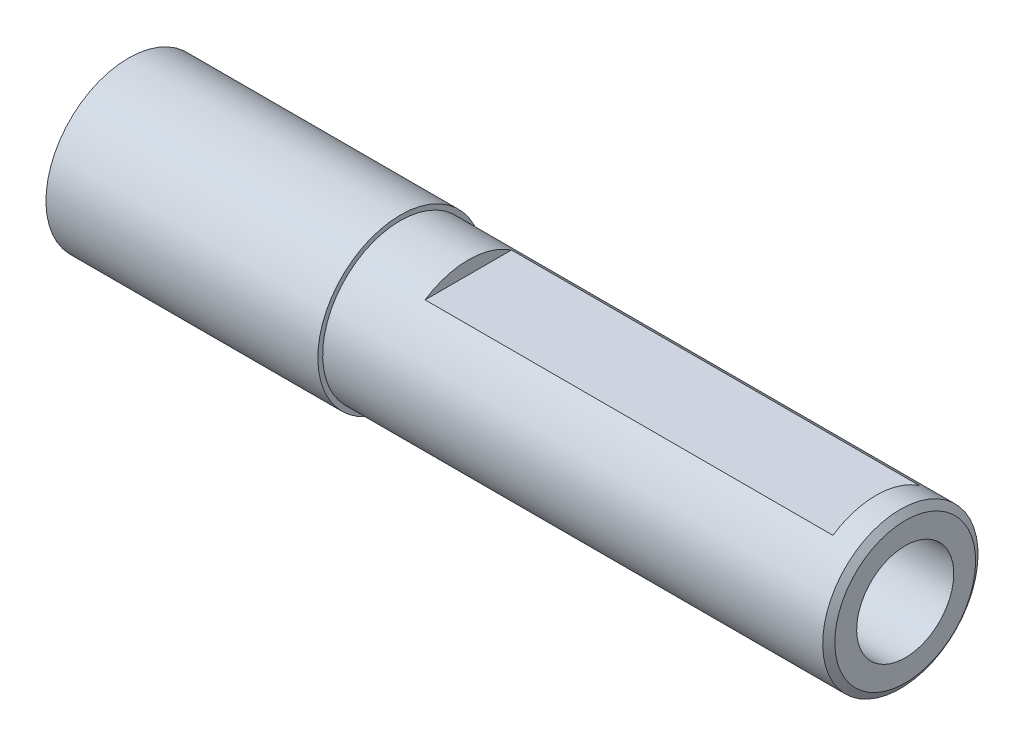
ISO-10303-21;
HEADER;
FILE_DESCRIPTION(('STEP AP214'),'2;1');
FILE_NAME('part.step','',(''),(''),'','','');
FILE_SCHEMA(('AUTOMOTIVE_DESIGN { 1 0 10303 214 1 1 1 1 }'));
ENDSEC;
DATA;
#1=APPLICATION_CONTEXT('core data for automotive mechanical design processes');
#2=APPLICATION_PROTOCOL_DEFINITION('international standard','automotive_design',2000,#1);
#3=PRODUCT_CONTEXT('',#1,'mechanical');
#4=PRODUCT('Part','Part','',(#3));
#5=PRODUCT_RELATED_PRODUCT_CATEGORY('part','',(#4));
#6=PRODUCT_DEFINITION_FORMATION('','',#4);
#7=PRODUCT_DEFINITION_CONTEXT('part definition',#1,'design');
#8=PRODUCT_DEFINITION('design','',#6,#7);
#9=PRODUCT_DEFINITION_SHAPE('','',#8);
#10=(LENGTH_UNIT() NAMED_UNIT(*) SI_UNIT(.MILLI.,.METRE.));
#11=(NAMED_UNIT(*) PLANE_ANGLE_UNIT() SI_UNIT($,.RADIAN.));
#12=(NAMED_UNIT(*) SI_UNIT($,.STERADIAN.) SOLID_ANGLE_UNIT());
#13=UNCERTAINTY_MEASURE_WITH_UNIT(LENGTH_MEASURE(1.E-05),#10,'distance_accuracy_value','');
#14=(GEOMETRIC_REPRESENTATION_CONTEXT(3) GLOBAL_UNCERTAINTY_ASSIGNED_CONTEXT((#13)) GLOBAL_UNIT_ASSIGNED_CONTEXT((#10,
#11,#12)) REPRESENTATION_CONTEXT('',''));
#15=CARTESIAN_POINT('',(0.,0.,0.));
#16=DIRECTION('',(0.,0.,1.));
#17=DIRECTION('',(1.,0.,0.));
#18=AXIS2_PLACEMENT_3D('',#15,#16,#17);
#19=CARTESIAN_POINT('',(52.,0.,0.));
#20=DIRECTION('',(1.,0.,0.));
#21=DIRECTION('',(0.,1.,0.));
#22=AXIS2_PLACEMENT_3D('',#19,#20,#21);
#23=CYLINDRICAL_SURFACE('',#22,8.);
#24=CARTESIAN_POINT('',(0.,0.,0.));
#25=DIRECTION('',(1.,0.,0.));
#26=DIRECTION('',(0.,1.,0.));
#27=AXIS2_PLACEMENT_3D('',#24,#25,#26);
#28=CIRCLE('',#27,8.);
#29=CARTESIAN_POINT('',(0.,7.99999999999999,0.));
#30=VERTEX_POINT('',#29);
#31=EDGE_CURVE('E62',#30,#30,#28,.T.);
#32=ORIENTED_EDGE('',*,*,#31,.T.);
#33=EDGE_LOOP('',(#32));
#34=FACE_BOUND('',#33,.T.);
#35=CARTESIAN_POINT('',(51.5,0.,0.));
#36=DIRECTION('',(1.,0.,0.));
#37=DIRECTION('',(0.,1.,0.));
#38=AXIS2_PLACEMENT_3D('',#35,#36,#37);
#39=CIRCLE('',#38,8.);
#40=CARTESIAN_POINT('',(51.5,8.,0.));
#41=VERTEX_POINT('',#40);
#42=EDGE_CURVE('E70',#41,#41,#39,.T.);
#43=ORIENTED_EDGE('',*,*,#42,.F.);
#44=EDGE_LOOP('',(#43));
#45=FACE_BOUND('',#44,.T.);
#46=DIRECTION('',(1.,0.,0.));
#47=VECTOR('',#46,1.);
#48=CARTESIAN_POINT('',(52.,6.65,4.44719012411207));
#49=LINE('',#48,#47);
#50=CARTESIAN_POINT('',(7.,6.64999999999999,4.44719012411207));
#51=VERTEX_POINT('',#50);
#52=CARTESIAN_POINT('',(49.,6.65,4.44719012411207));
#53=VERTEX_POINT('',#52);
#54=EDGE_CURVE('E39',#51,#53,#49,.T.);
#55=ORIENTED_EDGE('',*,*,#54,.F.);
#56=CARTESIAN_POINT('',(7.00000000000001,0.,0.));
#57=DIRECTION('',(1.,0.,0.));
#58=DIRECTION('',(0.,1.,0.));
#59=AXIS2_PLACEMENT_3D('',#56,#57,#58);
#60=CIRCLE('',#59,8.);
#61=CARTESIAN_POINT('',(7.,6.64999999999999,-4.44719012411207));
#62=VERTEX_POINT('',#61);
#63=EDGE_CURVE('E11',#62,#51,#60,.T.);
#64=ORIENTED_EDGE('',*,*,#63,.F.);
#65=DIRECTION('',(1.,0.,0.));
#66=VECTOR('',#65,1.);
#67=CARTESIAN_POINT('',(52.,6.65,-4.44719012411207));
#68=LINE('',#67,#66);
#69=CARTESIAN_POINT('',(49.,6.65,-4.44719012411207));
#70=VERTEX_POINT('',#69);
#71=EDGE_CURVE('E46',#70,#62,#68,.F.);
#72=ORIENTED_EDGE('',*,*,#71,.F.);
#73=CARTESIAN_POINT('',(49.,0.,0.));
#74=DIRECTION('',(-1.,0.,0.));
#75=DIRECTION('',(0.,0.,1.));
#76=AXIS2_PLACEMENT_3D('',#73,#74,#75);
#77=CIRCLE('',#76,8.);
#78=EDGE_CURVE('E58',#53,#70,#77,.T.);
#79=ORIENTED_EDGE('',*,*,#78,.F.);
#80=EDGE_LOOP('',(#55,#64,#72,#79));
#81=FACE_BOUND('',#80,.T.);
#82=ADVANCED_FACE('F32',(#34,#45,#81),#23,.T.);
#83=CARTESIAN_POINT('',(0.,0.,0.));
#84=DIRECTION('',(-1.,0.,0.));
#85=DIRECTION('',(0.,-1.,0.));
#86=AXIS2_PLACEMENT_3D('',#83,#84,#85);
#87=PLANE('',#86);
#88=ORIENTED_EDGE('',*,*,#31,.F.);
#89=EDGE_LOOP('',(#88));
#90=FACE_BOUND('',#89,.T.);
#91=CARTESIAN_POINT('',(0.,0.,0.));
#92=DIRECTION('',(1.,0.,0.));
#93=DIRECTION('',(0.,1.,0.));
#94=AXIS2_PLACEMENT_3D('',#91,#92,#93);
#95=CIRCLE('',#94,8.5);
#96=CARTESIAN_POINT('',(0.,8.49999999999999,0.));
#97=VERTEX_POINT('',#96);
#98=EDGE_CURVE('E85',#97,#97,#95,.T.);
#99=ORIENTED_EDGE('',*,*,#98,.T.);
#100=EDGE_LOOP('',(#99));
#101=FACE_BOUND('',#100,.T.);
#102=ADVANCED_FACE('F94',(#90,#101),#87,.F.);
#103=CARTESIAN_POINT('',(52.,0.,0.));
#104=DIRECTION('',(1.,0.,0.));
#105=DIRECTION('',(0.,1.,0.));
#106=AXIS2_PLACEMENT_3D('',#103,#104,#105);
#107=CYLINDRICAL_SURFACE('',#106,8.5);
#108=ORIENTED_EDGE('',*,*,#98,.F.);
#109=EDGE_LOOP('',(#108));
#110=FACE_BOUND('',#109,.T.);
#111=CARTESIAN_POINT('',(-28.,0.,0.));
#112=DIRECTION('',(1.,0.,0.));
#113=DIRECTION('',(0.,1.,0.));
#114=AXIS2_PLACEMENT_3D('',#111,#112,#113);
#115=CIRCLE('',#114,8.5);
#116=CARTESIAN_POINT('',(-28.,8.49999999999999,0.));
#117=VERTEX_POINT('',#116);
#118=EDGE_CURVE('E82',#117,#117,#115,.T.);
#119=ORIENTED_EDGE('',*,*,#118,.T.);
#120=EDGE_LOOP('',(#119));
#121=FACE_BOUND('',#120,.T.);
#122=ADVANCED_FACE('F97',(#110,#121),#107,.T.);
#123=CARTESIAN_POINT('',(-28.,0.,0.));
#124=DIRECTION('',(1.,0.,0.));
#125=DIRECTION('',(0.,1.,0.));
#126=AXIS2_PLACEMENT_3D('',#123,#124,#125);
#127=PLANE('',#126);
#128=ORIENTED_EDGE('',*,*,#118,.F.);
#129=EDGE_LOOP('',(#128));
#130=FACE_BOUND('',#129,.T.);
#131=ADVANCED_FACE('F102',(#130),#127,.F.);
#132=CARTESIAN_POINT('',(52.,0.,0.));
#133=DIRECTION('',(-1.,0.,0.));
#134=DIRECTION('',(0.,-1.,0.));
#135=AXIS2_PLACEMENT_3D('',#132,#133,#134);
#136=PLANE('',#135);
#137=CARTESIAN_POINT('',(52.,0.,0.));
#138=DIRECTION('',(1.,0.,0.));
#139=DIRECTION('',(0.,1.,0.));
#140=AXIS2_PLACEMENT_3D('',#137,#138,#139);
#141=CIRCLE('',#140,5.);
#142=CARTESIAN_POINT('',(52.,5.,0.));
#143=VERTEX_POINT('',#142);
#144=EDGE_CURVE('E73',#143,#143,#141,.T.);
#145=ORIENTED_EDGE('',*,*,#144,.F.);
#146=EDGE_LOOP('',(#145));
#147=FACE_BOUND('',#146,.T.);
#148=CARTESIAN_POINT('',(52.,0.,0.));
#149=DIRECTION('',(1.,0.,0.));
#150=DIRECTION('',(0.,1.,0.));
#151=AXIS2_PLACEMENT_3D('',#148,#149,#150);
#152=CIRCLE('',#151,7.25069297019762);
#153=CARTESIAN_POINT('',(52.,7.25069297019762,0.));
#154=VERTEX_POINT('',#153);
#155=EDGE_CURVE('E79',#154,#154,#152,.T.);
#156=ORIENTED_EDGE('',*,*,#155,.T.);
#157=EDGE_LOOP('',(#156));
#158=FACE_BOUND('',#157,.T.);
#159=ADVANCED_FACE('F107',(#147,#158),#136,.F.);
#160=CARTESIAN_POINT('',(51.5,0.,0.));
#161=DIRECTION('',(-1.,0.,0.));
#162=DIRECTION('',(0.,-1.,0.));
#163=AXIS2_PLACEMENT_3D('',#160,#161,#162);
#164=CONICAL_SURFACE('',#163,8.,0.982367007119399);
#165=ORIENTED_EDGE('',*,*,#155,.F.);
#166=EDGE_LOOP('',(#165));
#167=FACE_BOUND('',#166,.T.);
#168=ORIENTED_EDGE('',*,*,#42,.T.);
#169=EDGE_LOOP('',(#168));
#170=FACE_BOUND('',#169,.T.);
#171=ADVANCED_FACE('F112',(#167,#170),#164,.T.);
#172=CARTESIAN_POINT('',(7.,7.99999999999999,10.));
#173=DIRECTION('',(1.,0.,0.));
#174=DIRECTION('',(0.,1.,0.));
#175=AXIS2_PLACEMENT_3D('',#172,#173,#174);
#176=PLANE('',#175);
#177=ORIENTED_EDGE('',*,*,#63,.T.);
#178=DIRECTION('',(0.,0.,-1.));
#179=VECTOR('',#178,1.);
#180=CARTESIAN_POINT('',(7.,6.64999999999999,10.));
#181=LINE('',#180,#179);
#182=EDGE_CURVE('E66',#51,#62,#181,.T.);
#183=ORIENTED_EDGE('',*,*,#182,.T.);
#184=EDGE_LOOP('',(#177,#183));
#185=FACE_BOUND('',#184,.T.);
#186=ADVANCED_FACE('F140',(#185),#176,.T.);
#187=CARTESIAN_POINT('',(7.,6.64999999999999,10.));
#188=DIRECTION('',(0.,1.,0.));
#189=DIRECTION('',(-1.,0.,0.));
#190=AXIS2_PLACEMENT_3D('',#187,#188,#189);
#191=PLANE('',#190);
#192=ORIENTED_EDGE('',*,*,#54,.T.);
#193=DIRECTION('',(0.,0.,-1.));
#194=VECTOR('',#193,1.);
#195=CARTESIAN_POINT('',(49.,6.65,10.));
#196=LINE('',#195,#194);
#197=EDGE_CURVE('E65',#53,#70,#196,.T.);
#198=ORIENTED_EDGE('',*,*,#197,.T.);
#199=ORIENTED_EDGE('',*,*,#71,.T.);
#200=ORIENTED_EDGE('',*,*,#182,.F.);
#201=EDGE_LOOP('',(#192,#198,#199,#200));
#202=FACE_BOUND('',#201,.T.);
#203=ADVANCED_FACE('F64',(#202),#191,.T.);
#204=CARTESIAN_POINT('',(49.,6.65,10.));
#205=DIRECTION('',(-1.,0.,0.));
#206=DIRECTION('',(0.,0.,1.));
#207=AXIS2_PLACEMENT_3D('',#204,#205,#206);
#208=PLANE('',#207);
#209=ORIENTED_EDGE('',*,*,#197,.F.);
#210=ORIENTED_EDGE('',*,*,#78,.T.);
#211=EDGE_LOOP('',(#209,#210));
#212=FACE_BOUND('',#211,.T.);
#213=ADVANCED_FACE('F67',(#212),#208,.T.);
#214=CARTESIAN_POINT('',(-27.4750651456031,0.,0.));
#215=DIRECTION('',(1.,0.,0.));
#216=DIRECTION('',(0.,1.,0.));
#217=AXIS2_PLACEMENT_3D('',#214,#215,#216);
#218=CYLINDRICAL_SURFACE('',#217,5.);
#219=CARTESIAN_POINT('',(-27.4750651456031,0.,0.));
#220=DIRECTION('',(1.,0.,0.));
#221=DIRECTION('',(0.,1.,0.));
#222=AXIS2_PLACEMENT_3D('',#219,#220,#221);
#223=CIRCLE('',#222,5.);
#224=CARTESIAN_POINT('',(-27.4750651456031,4.99999999999999,0.));
#225=VERTEX_POINT('',#224);
#226=EDGE_CURVE('E68',#225,#225,#223,.T.);
#227=ORIENTED_EDGE('',*,*,#226,.F.);
#228=EDGE_LOOP('',(#227));
#229=FACE_BOUND('',#228,.T.);
#230=ORIENTED_EDGE('',*,*,#144,.T.);
#231=EDGE_LOOP('',(#230));
#232=FACE_BOUND('',#231,.T.);
#233=ADVANCED_FACE('F164',(#229,#232),#218,.F.);
#234=CARTESIAN_POINT('',(-27.4750651456031,0.,0.));
#235=DIRECTION('',(1.,0.,0.));
#236=DIRECTION('',(0.,1.,0.));
#237=AXIS2_PLACEMENT_3D('',#234,#235,#236);
#238=PLANE('',#237);
#239=ORIENTED_EDGE('',*,*,#226,.T.);
#240=EDGE_LOOP('',(#239));
#241=FACE_BOUND('',#240,.T.);
#242=ADVANCED_FACE('F171',(#241),#238,.T.);
#243=CLOSED_SHELL('',(#82,#102,#122,#131,#159,#171,#186,#203,#213,#233,#242));
#244=MANIFOLD_SOLID_BREP('B2',#243);
#245=ADVANCED_BREP_SHAPE_REPRESENTATION('',(#18,#244),#14);
#246=SHAPE_DEFINITION_REPRESENTATION(#9,#245);
ENDSEC;
END-ISO-10303-21;
